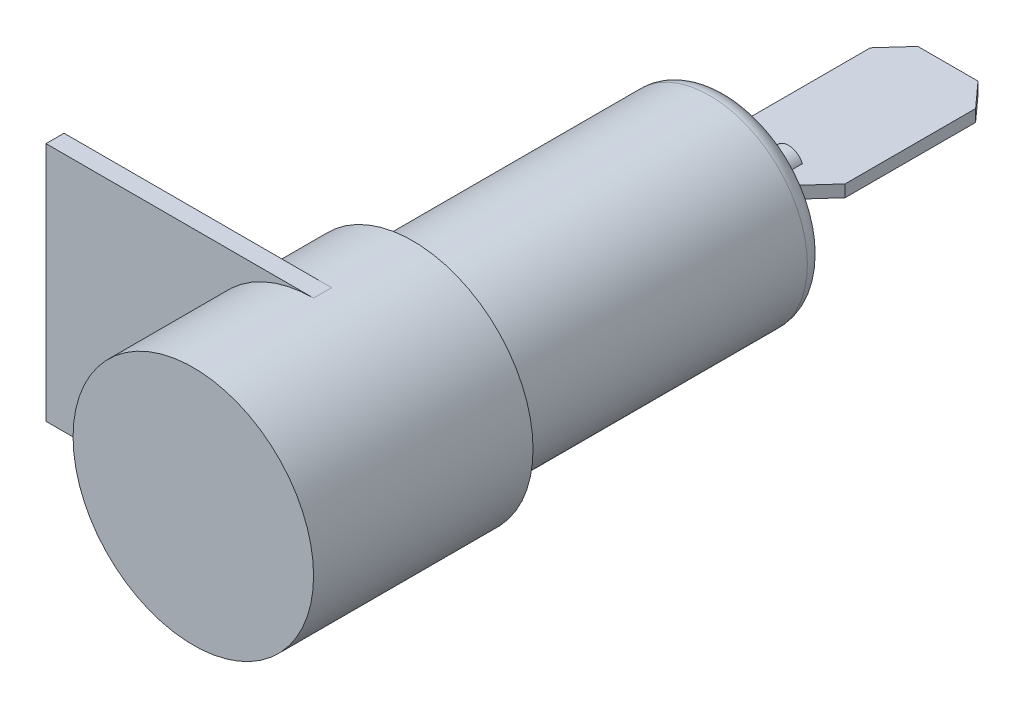
ISO-10303-21;
HEADER;
FILE_DESCRIPTION(('STEP AP214'),'2;1');
FILE_NAME('part.step','',(''),(''),'','','');
FILE_SCHEMA(('AUTOMOTIVE_DESIGN { 1 0 10303 214 1 1 1 1 }'));
ENDSEC;
DATA;
#1=APPLICATION_CONTEXT('core data for automotive mechanical design processes');
#2=APPLICATION_PROTOCOL_DEFINITION('international standard','automotive_design',2000,#1);
#3=PRODUCT_CONTEXT('',#1,'mechanical');
#4=PRODUCT('Part','Part','',(#3));
#5=PRODUCT_RELATED_PRODUCT_CATEGORY('part','',(#4));
#6=PRODUCT_DEFINITION_FORMATION('','',#4);
#7=PRODUCT_DEFINITION_CONTEXT('part definition',#1,'design');
#8=PRODUCT_DEFINITION('design','',#6,#7);
#9=PRODUCT_DEFINITION_SHAPE('','',#8);
#10=(LENGTH_UNIT() NAMED_UNIT(*) SI_UNIT(.MILLI.,.METRE.));
#11=(NAMED_UNIT(*) PLANE_ANGLE_UNIT() SI_UNIT($,.RADIAN.));
#12=(NAMED_UNIT(*) SI_UNIT($,.STERADIAN.) SOLID_ANGLE_UNIT());
#13=UNCERTAINTY_MEASURE_WITH_UNIT(LENGTH_MEASURE(1.E-05),#10,'distance_accuracy_value','');
#14=(GEOMETRIC_REPRESENTATION_CONTEXT(3) GLOBAL_UNCERTAINTY_ASSIGNED_CONTEXT((#13)) GLOBAL_UNIT_ASSIGNED_CONTEXT((#10,
#11,#12)) REPRESENTATION_CONTEXT('',''));
#15=CARTESIAN_POINT('',(0.,0.,0.));
#16=DIRECTION('',(0.,0.,1.));
#17=DIRECTION('',(1.,0.,0.));
#18=AXIS2_PLACEMENT_3D('',#15,#16,#17);
#19=CARTESIAN_POINT('',(-1.,0.,-31.6));
#20=DIRECTION('',(0.,0.,1.));
#21=DIRECTION('',(1.,0.,0.));
#22=AXIS2_PLACEMENT_3D('',#19,#20,#21);
#23=PLANE('',#22);
#24=DIRECTION('',(1.,0.,0.));
#25=VECTOR('',#24,1.);
#26=CARTESIAN_POINT('',(-1.,0.4,-31.6));
#27=LINE('',#26,#25);
#28=CARTESIAN_POINT('',(-0.916515138991168,0.4,-31.6));
#29=VERTEX_POINT('',#28);
#30=CARTESIAN_POINT('',(0.916515138991164,0.4,-31.6));
#31=VERTEX_POINT('',#30);
#32=EDGE_CURVE('E176',#29,#31,#27,.T.);
#33=ORIENTED_EDGE('',*,*,#32,.F.);
#34=CARTESIAN_POINT('',(0.,0.,-31.6));
#35=DIRECTION('',(0.,0.,1.));
#36=DIRECTION('',(1.,0.,0.));
#37=AXIS2_PLACEMENT_3D('',#34,#35,#36);
#38=CIRCLE('',#37,0.999999999999998);
#39=EDGE_CURVE('E227',#31,#29,#38,.T.);
#40=ORIENTED_EDGE('',*,*,#39,.F.);
#41=EDGE_LOOP('',(#33,#40));
#42=FACE_BOUND('',#41,.T.);
#43=ADVANCED_FACE('F34',(#42),#23,.F.);
#44=CARTESIAN_POINT('',(0.,0.,8.));
#45=DIRECTION('',(0.,0.,1.));
#46=DIRECTION('',(1.,0.,0.));
#47=AXIS2_PLACEMENT_3D('',#44,#45,#46);
#48=CYLINDRICAL_SURFACE('',#47,0.999999999999998);
#49=CARTESIAN_POINT('',(0.,0.,-27.6));
#50=DIRECTION('',(0.,0.,1.));
#51=DIRECTION('',(1.,0.,0.));
#52=AXIS2_PLACEMENT_3D('',#49,#50,#51);
#53=CIRCLE('',#52,0.999999999999998);
#54=CARTESIAN_POINT('',(0.999999999999997,0.,-27.6));
#55=VERTEX_POINT('',#54);
#56=EDGE_CURVE('E223',#55,#55,#53,.T.);
#57=ORIENTED_EDGE('',*,*,#56,.F.);
#58=EDGE_LOOP('',(#57));
#59=FACE_BOUND('',#58,.T.);
#60=DIRECTION('',(0.,0.,1.));
#61=VECTOR('',#60,1.);
#62=CARTESIAN_POINT('',(0.916515138991164,0.4,8.));
#63=LINE('',#62,#61);
#64=CARTESIAN_POINT('',(0.916515138991164,0.4,-30.2));
#65=VERTEX_POINT('',#64);
#66=EDGE_CURVE('E11',#31,#65,#63,.T.);
#67=ORIENTED_EDGE('',*,*,#66,.F.);
#68=ORIENTED_EDGE('',*,*,#39,.T.);
#69=DIRECTION('',(0.,0.,1.));
#70=VECTOR('',#69,1.);
#71=CARTESIAN_POINT('',(-0.916515138991168,0.4,8.));
#72=LINE('',#71,#70);
#73=CARTESIAN_POINT('',(-0.916515138991168,0.4,-30.2));
#74=VERTEX_POINT('',#73);
#75=EDGE_CURVE('E238',#74,#29,#72,.F.);
#76=ORIENTED_EDGE('',*,*,#75,.F.);
#77=CARTESIAN_POINT('',(0.,0.,-30.2));
#78=DIRECTION('',(0.,0.,-1.));
#79=DIRECTION('',(-1.,0.,0.));
#80=AXIS2_PLACEMENT_3D('',#77,#78,#79);
#81=CIRCLE('',#80,0.999999999999998);
#82=CARTESIAN_POINT('',(-0.916515138991168,-0.4,-30.2));
#83=VERTEX_POINT('',#82);
#84=EDGE_CURVE('E155',#83,#74,#81,.T.);
#85=ORIENTED_EDGE('',*,*,#84,.F.);
#86=DIRECTION('',(0.,0.,1.));
#87=VECTOR('',#86,1.);
#88=CARTESIAN_POINT('',(-0.916515138991168,-0.4,8.));
#89=LINE('',#88,#87);
#90=CARTESIAN_POINT('',(-0.916515138991168,-0.4,-31.6));
#91=VERTEX_POINT('',#90);
#92=EDGE_CURVE('E235',#83,#91,#89,.F.);
#93=ORIENTED_EDGE('',*,*,#92,.T.);
#94=CARTESIAN_POINT('',(0.916515138991164,-0.4,-31.6));
#95=VERTEX_POINT('',#94);
#96=EDGE_CURVE('E226',#91,#95,#38,.T.);
#97=ORIENTED_EDGE('',*,*,#96,.T.);
#98=DIRECTION('',(0.,0.,1.));
#99=VECTOR('',#98,1.);
#100=CARTESIAN_POINT('',(0.916515138991164,-0.4,8.));
#101=LINE('',#100,#99);
#102=CARTESIAN_POINT('',(0.916515138991164,-0.4,-30.2));
#103=VERTEX_POINT('',#102);
#104=EDGE_CURVE('E239',#95,#103,#101,.T.);
#105=ORIENTED_EDGE('',*,*,#104,.T.);
#106=EDGE_CURVE('E42',#65,#103,#81,.T.);
#107=ORIENTED_EDGE('',*,*,#106,.F.);
#108=EDGE_LOOP('',(#67,#68,#76,#85,#93,#97,#105,#107));
#109=FACE_BOUND('',#108,.T.);
#110=ADVANCED_FACE('F322',(#59,#109),#48,.T.);
#111=CARTESIAN_POINT('',(0.,0.,8.));
#112=DIRECTION('',(0.,0.,1.));
#113=DIRECTION('',(1.,0.,0.));
#114=AXIS2_PLACEMENT_3D('',#111,#112,#113);
#115=CYLINDRICAL_SURFACE('',#114,8.);
#116=CARTESIAN_POINT('',(0.,0.,-6.6));
#117=DIRECTION('',(0.,0.,1.));
#118=DIRECTION('',(1.,0.,0.));
#119=AXIS2_PLACEMENT_3D('',#116,#117,#118);
#120=CIRCLE('',#119,8.);
#121=CARTESIAN_POINT('',(8.,0.,-6.6));
#122=VERTEX_POINT('',#121);
#123=EDGE_CURVE('E211',#122,#122,#120,.T.);
#124=ORIENTED_EDGE('',*,*,#123,.T.);
#125=EDGE_LOOP('',(#124));
#126=FACE_BOUND('',#125,.T.);
#127=CARTESIAN_POINT('',(0.,0.,8.));
#128=DIRECTION('',(0.,0.,1.));
#129=DIRECTION('',(1.,0.,0.));
#130=AXIS2_PLACEMENT_3D('',#127,#128,#129);
#131=CIRCLE('',#130,8.);
#132=CARTESIAN_POINT('',(8.,0.,8.));
#133=VERTEX_POINT('',#132);
#134=EDGE_CURVE('E202',#133,#133,#131,.T.);
#135=ORIENTED_EDGE('',*,*,#134,.F.);
#136=EDGE_LOOP('',(#135));
#137=FACE_BOUND('',#136,.T.);
#138=CARTESIAN_POINT('',(0.,0.,-1.2));
#139=DIRECTION('',(0.,0.,1.));
#140=DIRECTION('',(1.,0.,0.));
#141=AXIS2_PLACEMENT_3D('',#138,#139,#140);
#142=CIRCLE('',#141,8.);
#143=CARTESIAN_POINT('',(0.,8.,-1.2));
#144=VERTEX_POINT('',#143);
#145=CARTESIAN_POINT('',(0.,-8.,-1.2));
#146=VERTEX_POINT('',#145);
#147=EDGE_CURVE('E233',#144,#146,#142,.T.);
#148=ORIENTED_EDGE('',*,*,#147,.F.);
#149=DIRECTION('',(0.,0.,1.));
#150=VECTOR('',#149,1.);
#151=CARTESIAN_POINT('',(0.,8.,-1.2));
#152=LINE('',#151,#150);
#153=CARTESIAN_POINT('',(0.,8.,0.));
#154=VERTEX_POINT('',#153);
#155=EDGE_CURVE('E194',#144,#154,#152,.T.);
#156=ORIENTED_EDGE('',*,*,#155,.T.);
#157=CARTESIAN_POINT('',(0.,0.,0.));
#158=DIRECTION('',(0.,0.,1.));
#159=DIRECTION('',(1.,0.,0.));
#160=AXIS2_PLACEMENT_3D('',#157,#158,#159);
#161=CIRCLE('',#160,8.);
#162=CARTESIAN_POINT('',(0.,-8.,0.));
#163=VERTEX_POINT('',#162);
#164=EDGE_CURVE('E230',#154,#163,#161,.T.);
#165=ORIENTED_EDGE('',*,*,#164,.T.);
#166=DIRECTION('',(0.,0.,1.));
#167=VECTOR('',#166,1.);
#168=CARTESIAN_POINT('',(0.,-8.,-1.2));
#169=LINE('',#168,#167);
#170=EDGE_CURVE('E200',#146,#163,#169,.T.);
#171=ORIENTED_EDGE('',*,*,#170,.F.);
#172=EDGE_LOOP('',(#148,#156,#165,#171));
#173=FACE_BOUND('',#172,.T.);
#174=ADVANCED_FACE('F327',(#126,#137,#173),#115,.T.);
#175=ORIENTED_EDGE('',*,*,#96,.F.);
#176=DIRECTION('',(1.,0.,0.));
#177=VECTOR('',#176,1.);
#178=CARTESIAN_POINT('',(-1.,-0.4,-31.6));
#179=LINE('',#178,#177);
#180=EDGE_CURVE('E49',#91,#95,#179,.T.);
#181=ORIENTED_EDGE('',*,*,#180,.T.);
#182=EDGE_LOOP('',(#175,#181));
#183=FACE_BOUND('',#182,.T.);
#184=ADVANCED_FACE('F36',(#183),#23,.F.);
#185=CARTESIAN_POINT('',(-5.25,0.,-27.6));
#186=DIRECTION('',(0.,0.,1.));
#187=DIRECTION('',(1.,0.,0.));
#188=AXIS2_PLACEMENT_3D('',#185,#186,#187);
#189=PLANE('',#188);
#190=CARTESIAN_POINT('',(0.,0.,-27.6));
#191=DIRECTION('',(0.,0.,1.));
#192=DIRECTION('',(1.,0.,0.));
#193=AXIS2_PLACEMENT_3D('',#190,#191,#192);
#194=CIRCLE('',#193,5.25);
#195=CARTESIAN_POINT('',(5.25,0.,-27.6));
#196=VERTEX_POINT('',#195);
#197=EDGE_CURVE('E220',#196,#196,#194,.T.);
#198=ORIENTED_EDGE('',*,*,#197,.F.);
#199=EDGE_LOOP('',(#198));
#200=FACE_BOUND('',#199,.T.);
#201=ORIENTED_EDGE('',*,*,#56,.T.);
#202=EDGE_LOOP('',(#201));
#203=FACE_BOUND('',#202,.T.);
#204=ADVANCED_FACE('F331',(#200,#203),#189,.F.);
#205=CARTESIAN_POINT('',(0.,0.,-26.35));
#206=DIRECTION('',(0.,0.,1.));
#207=DIRECTION('',(1.,0.,0.));
#208=AXIS2_PLACEMENT_3D('',#205,#206,#207);
#209=TOROIDAL_SURFACE('',#208,5.25,1.25);
#210=CARTESIAN_POINT('',(0.,0.,-26.35));
#211=DIRECTION('',(0.,0.,1.));
#212=DIRECTION('',(1.,0.,0.));
#213=AXIS2_PLACEMENT_3D('',#210,#211,#212);
#214=CIRCLE('',#213,6.5);
#215=CARTESIAN_POINT('',(6.5,0.,-26.35));
#216=VERTEX_POINT('',#215);
#217=EDGE_CURVE('E217',#216,#216,#214,.T.);
#218=ORIENTED_EDGE('',*,*,#217,.F.);
#219=EDGE_LOOP('',(#218));
#220=FACE_BOUND('',#219,.T.);
#221=ORIENTED_EDGE('',*,*,#197,.T.);
#222=EDGE_LOOP('',(#221));
#223=FACE_BOUND('',#222,.T.);
#224=ADVANCED_FACE('F337',(#220,#223),#209,.T.);
#225=CARTESIAN_POINT('',(0.,0.,8.));
#226=DIRECTION('',(0.,0.,1.));
#227=DIRECTION('',(1.,0.,0.));
#228=AXIS2_PLACEMENT_3D('',#225,#226,#227);
#229=CYLINDRICAL_SURFACE('',#228,6.5);
#230=CARTESIAN_POINT('',(0.,0.,-6.8));
#231=DIRECTION('',(0.,0.,1.));
#232=DIRECTION('',(1.,0.,0.));
#233=AXIS2_PLACEMENT_3D('',#230,#231,#232);
#234=CIRCLE('',#233,6.5);
#235=CARTESIAN_POINT('',(6.5,0.,-6.8));
#236=VERTEX_POINT('',#235);
#237=EDGE_CURVE('E214',#236,#236,#234,.T.);
#238=ORIENTED_EDGE('',*,*,#237,.F.);
#239=EDGE_LOOP('',(#238));
#240=FACE_BOUND('',#239,.T.);
#241=ORIENTED_EDGE('',*,*,#217,.T.);
#242=EDGE_LOOP('',(#241));
#243=FACE_BOUND('',#242,.T.);
#244=ADVANCED_FACE('F497',(#240,#243),#229,.T.);
#245=CARTESIAN_POINT('',(0.,0.,-6.8));
#246=DIRECTION('',(0.,0.,1.));
#247=DIRECTION('',(1.,0.,0.));
#248=AXIS2_PLACEMENT_3D('',#245,#246,#247);
#249=CONICAL_SURFACE('',#248,6.5,1.43824479449822);
#250=ORIENTED_EDGE('',*,*,#123,.F.);
#251=EDGE_LOOP('',(#250));
#252=FACE_BOUND('',#251,.T.);
#253=ORIENTED_EDGE('',*,*,#237,.T.);
#254=EDGE_LOOP('',(#253));
#255=FACE_BOUND('',#254,.T.);
#256=ADVANCED_FACE('F488',(#252,#255),#249,.T.);
#257=CARTESIAN_POINT('',(0.,0.,8.));
#258=DIRECTION('',(0.,0.,-1.));
#259=DIRECTION('',(-1.,0.,0.));
#260=AXIS2_PLACEMENT_3D('',#257,#258,#259);
#261=PLANE('',#260);
#262=ORIENTED_EDGE('',*,*,#134,.T.);
#263=EDGE_LOOP('',(#262));
#264=FACE_BOUND('',#263,.T.);
#265=ADVANCED_FACE('F474',(#264),#261,.F.);
#266=CARTESIAN_POINT('',(0.,-8.,-1.2));
#267=DIRECTION('',(0.,-1.,0.));
#268=DIRECTION('',(1.,0.,0.));
#269=AXIS2_PLACEMENT_3D('',#266,#267,#268);
#270=PLANE('',#269);
#271=DIRECTION('',(1.,0.,0.));
#272=VECTOR('',#271,1.);
#273=CARTESIAN_POINT('',(0.,-8.,0.));
#274=LINE('',#273,#272);
#275=CARTESIAN_POINT('',(-17.8,-8.,0.));
#276=VERTEX_POINT('',#275);
#277=EDGE_CURVE('E57',#276,#163,#274,.T.);
#278=ORIENTED_EDGE('',*,*,#277,.F.);
#279=DIRECTION('',(0.,0.,1.));
#280=VECTOR('',#279,1.);
#281=CARTESIAN_POINT('',(-17.8,-8.,-1.2));
#282=LINE('',#281,#280);
#283=CARTESIAN_POINT('',(-17.8,-8.,-1.2));
#284=VERTEX_POINT('',#283);
#285=EDGE_CURVE('E203',#284,#276,#282,.T.);
#286=ORIENTED_EDGE('',*,*,#285,.F.);
#287=DIRECTION('',(1.,0.,0.));
#288=VECTOR('',#287,1.);
#289=CARTESIAN_POINT('',(0.,-8.,-1.2));
#290=LINE('',#289,#288);
#291=EDGE_CURVE('E191',#284,#146,#290,.T.);
#292=ORIENTED_EDGE('',*,*,#291,.T.);
#293=ORIENTED_EDGE('',*,*,#170,.T.);
#294=EDGE_LOOP('',(#278,#286,#292,#293));
#295=FACE_BOUND('',#294,.T.);
#296=ADVANCED_FACE('F465',(#295),#270,.T.);
#297=CARTESIAN_POINT('',(-17.8,-8.,-1.2));
#298=DIRECTION('',(-1.,0.,0.));
#299=DIRECTION('',(0.,0.,1.));
#300=AXIS2_PLACEMENT_3D('',#297,#298,#299);
#301=PLANE('',#300);
#302=DIRECTION('',(0.,-1.,0.));
#303=VECTOR('',#302,1.);
#304=CARTESIAN_POINT('',(-17.8,-8.,0.));
#305=LINE('',#304,#303);
#306=CARTESIAN_POINT('',(-17.8,8.,0.));
#307=VERTEX_POINT('',#306);
#308=EDGE_CURVE('E197',#307,#276,#305,.T.);
#309=ORIENTED_EDGE('',*,*,#308,.F.);
#310=DIRECTION('',(0.,0.,1.));
#311=VECTOR('',#310,1.);
#312=CARTESIAN_POINT('',(-17.8,8.,-1.2));
#313=LINE('',#312,#311);
#314=CARTESIAN_POINT('',(-17.8,8.,-1.2));
#315=VERTEX_POINT('',#314);
#316=EDGE_CURVE('E205',#315,#307,#313,.T.);
#317=ORIENTED_EDGE('',*,*,#316,.F.);
#318=DIRECTION('',(0.,-1.,0.));
#319=VECTOR('',#318,1.);
#320=CARTESIAN_POINT('',(-17.8,-8.,-1.2));
#321=LINE('',#320,#319);
#322=EDGE_CURVE('E188',#315,#284,#321,.T.);
#323=ORIENTED_EDGE('',*,*,#322,.T.);
#324=ORIENTED_EDGE('',*,*,#285,.T.);
#325=EDGE_LOOP('',(#309,#317,#323,#324));
#326=FACE_BOUND('',#325,.T.);
#327=ADVANCED_FACE('F456',(#326),#301,.T.);
#328=CARTESIAN_POINT('',(0.,8.,-1.2));
#329=DIRECTION('',(0.,1.,0.));
#330=DIRECTION('',(-1.,0.,0.));
#331=AXIS2_PLACEMENT_3D('',#328,#329,#330);
#332=PLANE('',#331);
#333=DIRECTION('',(-1.,0.,0.));
#334=VECTOR('',#333,1.);
#335=CARTESIAN_POINT('',(0.,8.,0.));
#336=LINE('',#335,#334);
#337=EDGE_CURVE('E184',#154,#307,#336,.T.);
#338=ORIENTED_EDGE('',*,*,#337,.F.);
#339=ORIENTED_EDGE('',*,*,#155,.F.);
#340=DIRECTION('',(-1.,0.,0.));
#341=VECTOR('',#340,1.);
#342=CARTESIAN_POINT('',(0.,8.,-1.2));
#343=LINE('',#342,#341);
#344=EDGE_CURVE('E185',#144,#315,#343,.T.);
#345=ORIENTED_EDGE('',*,*,#344,.T.);
#346=ORIENTED_EDGE('',*,*,#316,.T.);
#347=EDGE_LOOP('',(#338,#339,#345,#346));
#348=FACE_BOUND('',#347,.T.);
#349=ADVANCED_FACE('F447',(#348),#332,.T.);
#350=CARTESIAN_POINT('',(0.,0.,-1.2));
#351=DIRECTION('',(0.,0.,1.));
#352=DIRECTION('',(1.,0.,0.));
#353=AXIS2_PLACEMENT_3D('',#350,#351,#352);
#354=PLANE('',#353);
#355=ORIENTED_EDGE('',*,*,#344,.F.);
#356=ORIENTED_EDGE('',*,*,#147,.T.);
#357=ORIENTED_EDGE('',*,*,#291,.F.);
#358=ORIENTED_EDGE('',*,*,#322,.F.);
#359=EDGE_LOOP('',(#355,#356,#357,#358));
#360=FACE_BOUND('',#359,.T.);
#361=ADVANCED_FACE('F439',(#360),#354,.F.);
#362=CARTESIAN_POINT('',(0.,0.,0.));
#363=DIRECTION('',(0.,0.,1.));
#364=DIRECTION('',(1.,0.,0.));
#365=AXIS2_PLACEMENT_3D('',#362,#363,#364);
#366=PLANE('',#365);
#367=ORIENTED_EDGE('',*,*,#164,.F.);
#368=ORIENTED_EDGE('',*,*,#337,.T.);
#369=ORIENTED_EDGE('',*,*,#308,.T.);
#370=ORIENTED_EDGE('',*,*,#277,.T.);
#371=EDGE_LOOP('',(#367,#368,#369,#370));
#372=FACE_BOUND('',#371,.T.);
#373=ADVANCED_FACE('F423',(#372),#366,.T.);
#374=CARTESIAN_POINT('',(-2.,0.4,-30.2));
#375=DIRECTION('',(0.,0.,-1.));
#376=DIRECTION('',(-1.,0.,0.));
#377=AXIS2_PLACEMENT_3D('',#374,#375,#376);
#378=PLANE('',#377);
#379=DIRECTION('',(1.,0.,0.));
#380=VECTOR('',#379,1.);
#381=CARTESIAN_POINT('',(-2.,0.4,-30.2));
#382=LINE('',#381,#380);
#383=CARTESIAN_POINT('',(2.,0.4,-30.2));
#384=VERTEX_POINT('',#383);
#385=EDGE_CURVE('E159',#65,#384,#382,.T.);
#386=ORIENTED_EDGE('',*,*,#385,.F.);
#387=ORIENTED_EDGE('',*,*,#106,.T.);
#388=DIRECTION('',(1.,0.,0.));
#389=VECTOR('',#388,1.);
#390=CARTESIAN_POINT('',(-2.,-0.4,-30.2));
#391=LINE('',#390,#389);
#392=CARTESIAN_POINT('',(2.,-0.4,-30.2));
#393=VERTEX_POINT('',#392);
#394=EDGE_CURVE('E249',#103,#393,#391,.T.);
#395=ORIENTED_EDGE('',*,*,#394,.T.);
#396=DIRECTION('',(0.,-1.,0.));
#397=VECTOR('',#396,1.);
#398=CARTESIAN_POINT('',(2.,0.4,-30.2));
#399=LINE('',#398,#397);
#400=EDGE_CURVE('E174',#384,#393,#399,.T.);
#401=ORIENTED_EDGE('',*,*,#400,.F.);
#402=EDGE_LOOP('',(#386,#387,#395,#401));
#403=FACE_BOUND('',#402,.T.);
#404=ADVANCED_FACE('F247',(#403),#378,.F.);
#405=CARTESIAN_POINT('',(0.,0.4,0.));
#406=DIRECTION('',(0.,-1.,0.));
#407=DIRECTION('',(0.,0.,-1.));
#408=AXIS2_PLACEMENT_3D('',#405,#406,#407);
#409=PLANE('',#408);
#410=ORIENTED_EDGE('',*,*,#32,.T.);
#411=ORIENTED_EDGE('',*,*,#66,.T.);
#412=ORIENTED_EDGE('',*,*,#385,.T.);
#413=DIRECTION('',(0.67047773341551,0.,-0.741929652321566));
#414=VECTOR('',#413,1.);
#415=CARTESIAN_POINT('',(3.5,0.4,-31.8598530018485));
#416=LINE('',#415,#414);
#417=CARTESIAN_POINT('',(3.5,0.4,-31.8598530018485));
#418=VERTEX_POINT('',#417);
#419=EDGE_CURVE('E158',#384,#418,#416,.T.);
#420=ORIENTED_EDGE('',*,*,#419,.T.);
#421=DIRECTION('',(0.,0.,-1.));
#422=VECTOR('',#421,1.);
#423=CARTESIAN_POINT('',(3.5,0.4,-40.5401469981514));
#424=LINE('',#423,#422);
#425=CARTESIAN_POINT('',(3.5,0.4,-40.5401469981514));
#426=VERTEX_POINT('',#425);
#427=EDGE_CURVE('E289',#418,#426,#424,.T.);
#428=ORIENTED_EDGE('',*,*,#427,.T.);
#429=DIRECTION('',(-0.67047773341551,0.,-0.741929652321566));
#430=VECTOR('',#429,1.);
#431=CARTESIAN_POINT('',(3.5,0.4,-40.5401469981514));
#432=LINE('',#431,#430);
#433=CARTESIAN_POINT('',(2.,0.4,-42.2));
#434=VERTEX_POINT('',#433);
#435=EDGE_CURVE('E306',#426,#434,#432,.T.);
#436=ORIENTED_EDGE('',*,*,#435,.T.);
#437=DIRECTION('',(-1.,0.,0.));
#438=VECTOR('',#437,1.);
#439=CARTESIAN_POINT('',(2.,0.4,-42.2));
#440=LINE('',#439,#438);
#441=CARTESIAN_POINT('',(-2.,0.4,-42.2));
#442=VERTEX_POINT('',#441);
#443=EDGE_CURVE('E303',#434,#442,#440,.T.);
#444=ORIENTED_EDGE('',*,*,#443,.T.);
#445=DIRECTION('',(-0.670477733415511,0.,0.741929652321566));
#446=VECTOR('',#445,1.);
#447=CARTESIAN_POINT('',(-3.5,0.4,-40.5401469981514));
#448=LINE('',#447,#446);
#449=CARTESIAN_POINT('',(-3.5,0.4,-40.5401469981514));
#450=VERTEX_POINT('',#449);
#451=EDGE_CURVE('E305',#442,#450,#448,.T.);
#452=ORIENTED_EDGE('',*,*,#451,.T.);
#453=DIRECTION('',(0.,0.,1.));
#454=VECTOR('',#453,1.);
#455=CARTESIAN_POINT('',(-3.5,0.4,-31.8598530018485));
#456=LINE('',#455,#454);
#457=CARTESIAN_POINT('',(-3.5,0.4,-31.8598530018485));
#458=VERTEX_POINT('',#457);
#459=EDGE_CURVE('E165',#450,#458,#456,.T.);
#460=ORIENTED_EDGE('',*,*,#459,.T.);
#461=DIRECTION('',(0.670477733415511,0.,0.741929652321566));
#462=VECTOR('',#461,1.);
#463=CARTESIAN_POINT('',(-3.5,0.4,-31.8598530018485));
#464=LINE('',#463,#462);
#465=CARTESIAN_POINT('',(-2.,0.4,-30.2));
#466=VERTEX_POINT('',#465);
#467=EDGE_CURVE('E162',#458,#466,#464,.T.);
#468=ORIENTED_EDGE('',*,*,#467,.T.);
#469=EDGE_CURVE('E147',#466,#74,#382,.T.);
#470=ORIENTED_EDGE('',*,*,#469,.T.);
#471=ORIENTED_EDGE('',*,*,#75,.T.);
#472=EDGE_LOOP('',(#410,#411,#412,#420,#428,#436,#444,#452,#460,#468,#470,#471));
#473=FACE_BOUND('',#472,.T.);
#474=ADVANCED_FACE('F163',(#473),#409,.F.);
#475=CARTESIAN_POINT('',(0.,-0.4,0.));
#476=DIRECTION('',(0.,-1.,0.));
#477=DIRECTION('',(0.,0.,-1.));
#478=AXIS2_PLACEMENT_3D('',#475,#476,#477);
#479=PLANE('',#478);
#480=ORIENTED_EDGE('',*,*,#104,.F.);
#481=ORIENTED_EDGE('',*,*,#180,.F.);
#482=ORIENTED_EDGE('',*,*,#92,.F.);
#483=CARTESIAN_POINT('',(-2.,-0.4,-30.2));
#484=VERTEX_POINT('',#483);
#485=EDGE_CURVE('E255',#484,#83,#391,.T.);
#486=ORIENTED_EDGE('',*,*,#485,.F.);
#487=DIRECTION('',(0.670477733415511,0.,0.741929652321566));
#488=VECTOR('',#487,1.);
#489=CARTESIAN_POINT('',(-3.5,-0.4,-31.8598530018485));
#490=LINE('',#489,#488);
#491=CARTESIAN_POINT('',(-3.5,-0.4,-31.8598530018485));
#492=VERTEX_POINT('',#491);
#493=EDGE_CURVE('E173',#492,#484,#490,.T.);
#494=ORIENTED_EDGE('',*,*,#493,.F.);
#495=DIRECTION('',(0.,0.,1.));
#496=VECTOR('',#495,1.);
#497=CARTESIAN_POINT('',(-3.5,-0.4,-31.8598530018485));
#498=LINE('',#497,#496);
#499=CARTESIAN_POINT('',(-3.5,-0.4,-40.5401469981514));
#500=VERTEX_POINT('',#499);
#501=EDGE_CURVE('E169',#500,#492,#498,.T.);
#502=ORIENTED_EDGE('',*,*,#501,.F.);
#503=DIRECTION('',(-0.670477733415511,0.,0.741929652321566));
#504=VECTOR('',#503,1.);
#505=CARTESIAN_POINT('',(-3.5,-0.4,-40.5401469981514));
#506=LINE('',#505,#504);
#507=CARTESIAN_POINT('',(-2.,-0.4,-42.2));
#508=VERTEX_POINT('',#507);
#509=EDGE_CURVE('E267',#508,#500,#506,.T.);
#510=ORIENTED_EDGE('',*,*,#509,.F.);
#511=DIRECTION('',(-1.,0.,0.));
#512=VECTOR('',#511,1.);
#513=CARTESIAN_POINT('',(2.,-0.4,-42.2));
#514=LINE('',#513,#512);
#515=CARTESIAN_POINT('',(2.,-0.4,-42.2));
#516=VERTEX_POINT('',#515);
#517=EDGE_CURVE('E265',#516,#508,#514,.T.);
#518=ORIENTED_EDGE('',*,*,#517,.F.);
#519=DIRECTION('',(-0.67047773341551,0.,-0.741929652321566));
#520=VECTOR('',#519,1.);
#521=CARTESIAN_POINT('',(3.5,-0.4,-40.5401469981514));
#522=LINE('',#521,#520);
#523=CARTESIAN_POINT('',(3.5,-0.4,-40.5401469981514));
#524=VERTEX_POINT('',#523);
#525=EDGE_CURVE('E263',#524,#516,#522,.T.);
#526=ORIENTED_EDGE('',*,*,#525,.F.);
#527=DIRECTION('',(0.,0.,-1.));
#528=VECTOR('',#527,1.);
#529=CARTESIAN_POINT('',(3.5,-0.4,-40.5401469981514));
#530=LINE('',#529,#528);
#531=CARTESIAN_POINT('',(3.5,-0.4,-31.8598530018485));
#532=VERTEX_POINT('',#531);
#533=EDGE_CURVE('E261',#532,#524,#530,.T.);
#534=ORIENTED_EDGE('',*,*,#533,.F.);
#535=DIRECTION('',(0.67047773341551,0.,-0.741929652321566));
#536=VECTOR('',#535,1.);
#537=CARTESIAN_POINT('',(3.5,-0.4,-31.8598530018485));
#538=LINE('',#537,#536);
#539=EDGE_CURVE('E254',#393,#532,#538,.T.);
#540=ORIENTED_EDGE('',*,*,#539,.F.);
#541=ORIENTED_EDGE('',*,*,#394,.F.);
#542=EDGE_LOOP('',(#480,#481,#482,#486,#494,#502,#510,#518,#526,#534,#540,#541));
#543=FACE_BOUND('',#542,.T.);
#544=ADVANCED_FACE('F252',(#543),#479,.T.);
#545=CARTESIAN_POINT('',(-3.5,0.4,-31.8598530018485));
#546=DIRECTION('',(0.741929652321566,0.,-0.670477733415511));
#547=DIRECTION('',(-0.670477733415511,0.,-0.741929652321566));
#548=AXIS2_PLACEMENT_3D('',#545,#546,#547);
#549=PLANE('',#548);
#550=ORIENTED_EDGE('',*,*,#493,.T.);
#551=DIRECTION('',(0.,-1.,0.));
#552=VECTOR('',#551,1.);
#553=CARTESIAN_POINT('',(-2.,0.4,-30.2));
#554=LINE('',#553,#552);
#555=EDGE_CURVE('E152',#466,#484,#554,.T.);
#556=ORIENTED_EDGE('',*,*,#555,.F.);
#557=ORIENTED_EDGE('',*,*,#467,.F.);
#558=DIRECTION('',(0.,-1.,0.));
#559=VECTOR('',#558,1.);
#560=CARTESIAN_POINT('',(-3.5,0.4,-31.8598530018485));
#561=LINE('',#560,#559);
#562=EDGE_CURVE('E270',#458,#492,#561,.T.);
#563=ORIENTED_EDGE('',*,*,#562,.T.);
#564=EDGE_LOOP('',(#550,#556,#557,#563));
#565=FACE_BOUND('',#564,.T.);
#566=ADVANCED_FACE('F171',(#565),#549,.F.);
#567=ORIENTED_EDGE('',*,*,#485,.T.);
#568=ORIENTED_EDGE('',*,*,#84,.T.);
#569=ORIENTED_EDGE('',*,*,#469,.F.);
#570=ORIENTED_EDGE('',*,*,#555,.T.);
#571=EDGE_LOOP('',(#567,#568,#569,#570));
#572=FACE_BOUND('',#571,.T.);
#573=ADVANCED_FACE('F150',(#572),#378,.F.);
#574=CARTESIAN_POINT('',(3.5,0.4,-31.8598530018485));
#575=DIRECTION('',(-0.741929652321566,0.,-0.67047773341551));
#576=DIRECTION('',(-0.67047773341551,0.,0.741929652321566));
#577=AXIS2_PLACEMENT_3D('',#574,#575,#576);
#578=PLANE('',#577);
#579=ORIENTED_EDGE('',*,*,#539,.T.);
#580=DIRECTION('',(0.,-1.,0.));
#581=VECTOR('',#580,1.);
#582=CARTESIAN_POINT('',(3.5,0.4,-31.8598530018485));
#583=LINE('',#582,#581);
#584=EDGE_CURVE('E179',#418,#532,#583,.T.);
#585=ORIENTED_EDGE('',*,*,#584,.F.);
#586=ORIENTED_EDGE('',*,*,#419,.F.);
#587=ORIENTED_EDGE('',*,*,#400,.T.);
#588=EDGE_LOOP('',(#579,#585,#586,#587));
#589=FACE_BOUND('',#588,.T.);
#590=ADVANCED_FACE('F312',(#589),#578,.F.);
#591=CARTESIAN_POINT('',(3.5,0.4,-40.5401469981514));
#592=DIRECTION('',(-1.,0.,0.));
#593=DIRECTION('',(0.,0.,1.));
#594=AXIS2_PLACEMENT_3D('',#591,#592,#593);
#595=PLANE('',#594);
#596=ORIENTED_EDGE('',*,*,#533,.T.);
#597=DIRECTION('',(0.,-1.,0.));
#598=VECTOR('',#597,1.);
#599=CARTESIAN_POINT('',(3.5,0.4,-40.5401469981514));
#600=LINE('',#599,#598);
#601=EDGE_CURVE('E281',#426,#524,#600,.T.);
#602=ORIENTED_EDGE('',*,*,#601,.F.);
#603=ORIENTED_EDGE('',*,*,#427,.F.);
#604=ORIENTED_EDGE('',*,*,#584,.T.);
#605=EDGE_LOOP('',(#596,#602,#603,#604));
#606=FACE_BOUND('',#605,.T.);
#607=ADVANCED_FACE('F287',(#606),#595,.F.);
#608=CARTESIAN_POINT('',(3.5,0.4,-40.5401469981514));
#609=DIRECTION('',(-0.741929652321566,0.,0.67047773341551));
#610=DIRECTION('',(0.67047773341551,0.,0.741929652321566));
#611=AXIS2_PLACEMENT_3D('',#608,#609,#610);
#612=PLANE('',#611);
#613=ORIENTED_EDGE('',*,*,#525,.T.);
#614=DIRECTION('',(0.,-1.,0.));
#615=VECTOR('',#614,1.);
#616=CARTESIAN_POINT('',(2.,0.4,-42.2));
#617=LINE('',#616,#615);
#618=EDGE_CURVE('E278',#434,#516,#617,.T.);
#619=ORIENTED_EDGE('',*,*,#618,.F.);
#620=ORIENTED_EDGE('',*,*,#435,.F.);
#621=ORIENTED_EDGE('',*,*,#601,.T.);
#622=EDGE_LOOP('',(#613,#619,#620,#621));
#623=FACE_BOUND('',#622,.T.);
#624=ADVANCED_FACE('F297',(#623),#612,.F.);
#625=CARTESIAN_POINT('',(2.,0.4,-42.2));
#626=DIRECTION('',(0.,0.,1.));
#627=DIRECTION('',(1.,0.,0.));
#628=AXIS2_PLACEMENT_3D('',#625,#626,#627);
#629=PLANE('',#628);
#630=ORIENTED_EDGE('',*,*,#517,.T.);
#631=DIRECTION('',(0.,-1.,0.));
#632=VECTOR('',#631,1.);
#633=CARTESIAN_POINT('',(-2.,0.4,-42.2));
#634=LINE('',#633,#632);
#635=EDGE_CURVE('E275',#442,#508,#634,.T.);
#636=ORIENTED_EDGE('',*,*,#635,.F.);
#637=ORIENTED_EDGE('',*,*,#443,.F.);
#638=ORIENTED_EDGE('',*,*,#618,.T.);
#639=EDGE_LOOP('',(#630,#636,#637,#638));
#640=FACE_BOUND('',#639,.T.);
#641=ADVANCED_FACE('F301',(#640),#629,.F.);
#642=CARTESIAN_POINT('',(-3.5,0.4,-40.5401469981514));
#643=DIRECTION('',(0.741929652321566,0.,0.670477733415511));
#644=DIRECTION('',(0.670477733415511,0.,-0.741929652321566));
#645=AXIS2_PLACEMENT_3D('',#642,#643,#644);
#646=PLANE('',#645);
#647=ORIENTED_EDGE('',*,*,#509,.T.);
#648=DIRECTION('',(0.,-1.,0.));
#649=VECTOR('',#648,1.);
#650=CARTESIAN_POINT('',(-3.5,0.4,-40.5401469981514));
#651=LINE('',#650,#649);
#652=EDGE_CURVE('E272',#450,#500,#651,.T.);
#653=ORIENTED_EDGE('',*,*,#652,.F.);
#654=ORIENTED_EDGE('',*,*,#451,.F.);
#655=ORIENTED_EDGE('',*,*,#635,.T.);
#656=EDGE_LOOP('',(#647,#653,#654,#655));
#657=FACE_BOUND('',#656,.T.);
#658=ADVANCED_FACE('F348',(#657),#646,.F.);
#659=CARTESIAN_POINT('',(-3.5,0.4,-31.8598530018485));
#660=DIRECTION('',(1.,0.,0.));
#661=DIRECTION('',(0.,0.,-1.));
#662=AXIS2_PLACEMENT_3D('',#659,#660,#661);
#663=PLANE('',#662);
#664=ORIENTED_EDGE('',*,*,#501,.T.);
#665=ORIENTED_EDGE('',*,*,#562,.F.);
#666=ORIENTED_EDGE('',*,*,#459,.F.);
#667=ORIENTED_EDGE('',*,*,#652,.T.);
#668=EDGE_LOOP('',(#664,#665,#666,#667));
#669=FACE_BOUND('',#668,.T.);
#670=ADVANCED_FACE('F345',(#669),#663,.F.);
#671=CLOSED_SHELL('',(#43,#110,#174,#184,#204,#224,#244,#256,#265,#296,#327,#349,#361,#373,#404,
#474,#544,#566,#573,#590,#607,#624,#641,#658,#670));
#672=MANIFOLD_SOLID_BREP('B2',#671);
#673=ADVANCED_BREP_SHAPE_REPRESENTATION('',(#18,#672),#14);
#674=SHAPE_DEFINITION_REPRESENTATION(#9,#673);
ENDSEC;
END-ISO-10303-21;
